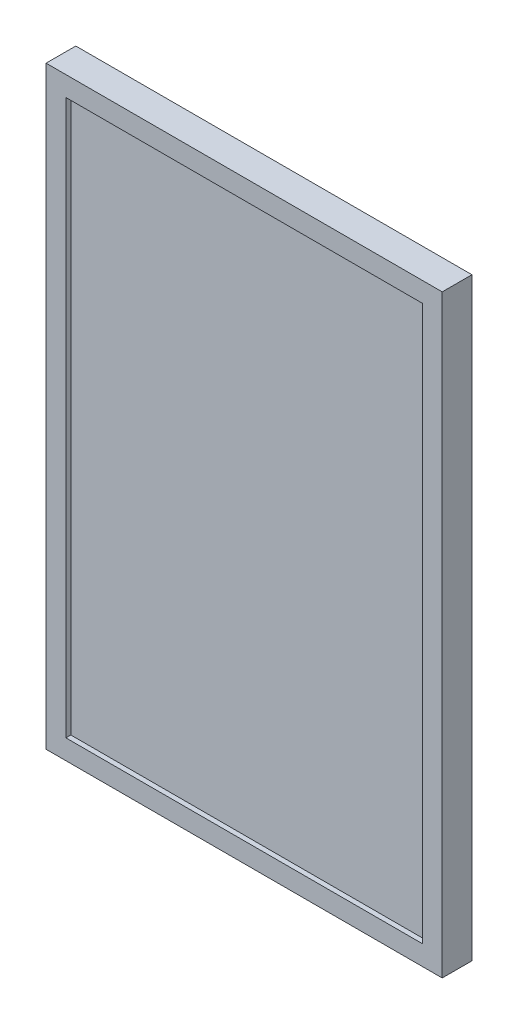
ISO-10303-21;
HEADER;
FILE_DESCRIPTION(('STEP AP214'),'2;1');
FILE_NAME('part.step','',(''),(''),'','','');
FILE_SCHEMA(('AUTOMOTIVE_DESIGN { 1 0 10303 214 1 1 1 1 }'));
ENDSEC;
DATA;
#1=APPLICATION_CONTEXT('core data for automotive mechanical design processes');
#2=APPLICATION_PROTOCOL_DEFINITION('international standard','automotive_design',2000,#1);
#3=PRODUCT_CONTEXT('',#1,'mechanical');
#4=PRODUCT('Part','Part','',(#3));
#5=PRODUCT_RELATED_PRODUCT_CATEGORY('part','',(#4));
#6=PRODUCT_DEFINITION_FORMATION('','',#4);
#7=PRODUCT_DEFINITION_CONTEXT('part definition',#1,'design');
#8=PRODUCT_DEFINITION('design','',#6,#7);
#9=PRODUCT_DEFINITION_SHAPE('','',#8);
#10=(LENGTH_UNIT() NAMED_UNIT(*) SI_UNIT(.MILLI.,.METRE.));
#11=(NAMED_UNIT(*) PLANE_ANGLE_UNIT() SI_UNIT($,.RADIAN.));
#12=(NAMED_UNIT(*) SI_UNIT($,.STERADIAN.) SOLID_ANGLE_UNIT());
#13=UNCERTAINTY_MEASURE_WITH_UNIT(LENGTH_MEASURE(1.E-05),#10,'distance_accuracy_value','');
#14=(GEOMETRIC_REPRESENTATION_CONTEXT(3) GLOBAL_UNCERTAINTY_ASSIGNED_CONTEXT((#13)) GLOBAL_UNIT_ASSIGNED_CONTEXT((#10,
#11,#12)) REPRESENTATION_CONTEXT('',''));
#15=CARTESIAN_POINT('',(0.,0.,0.));
#16=DIRECTION('',(0.,0.,1.));
#17=DIRECTION('',(1.,0.,0.));
#18=AXIS2_PLACEMENT_3D('',#15,#16,#17);
#19=CARTESIAN_POINT('',(-50.2324022346369,57.0435754189944,7.62));
#20=DIRECTION('',(1.,0.,0.));
#21=DIRECTION('',(0.,1.,0.));
#22=AXIS2_PLACEMENT_3D('',#19,#20,#21);
#23=PLANE('',#22);
#24=DIRECTION('',(0.,-1.,0.));
#25=VECTOR('',#24,1.);
#26=CARTESIAN_POINT('',(-50.2324022346369,57.0435754189944,0.));
#27=LINE('',#26,#25);
#28=CARTESIAN_POINT('',(-50.2324022346369,57.0435754189944,0.));
#29=VERTEX_POINT('',#28);
#30=CARTESIAN_POINT('',(-50.2324022346369,-95.3564245810056,0.));
#31=VERTEX_POINT('',#30);
#32=EDGE_CURVE('E144',#29,#31,#27,.T.);
#33=ORIENTED_EDGE('',*,*,#32,.T.);
#34=DIRECTION('',(0.,0.,-1.));
#35=VECTOR('',#34,1.);
#36=CARTESIAN_POINT('',(-50.2324022346369,-95.3564245810056,7.62));
#37=LINE('',#36,#35);
#38=CARTESIAN_POINT('',(-50.2324022346369,-95.3564245810056,7.62));
#39=VERTEX_POINT('',#38);
#40=EDGE_CURVE('E11',#39,#31,#37,.T.);
#41=ORIENTED_EDGE('',*,*,#40,.F.);
#42=DIRECTION('',(0.,-1.,0.));
#43=VECTOR('',#42,1.);
#44=CARTESIAN_POINT('',(-50.2324022346369,57.0435754189944,7.62));
#45=LINE('',#44,#43);
#46=CARTESIAN_POINT('',(-50.2324022346369,57.0435754189944,7.62));
#47=VERTEX_POINT('',#46);
#48=EDGE_CURVE('E148',#47,#39,#45,.T.);
#49=ORIENTED_EDGE('',*,*,#48,.F.);
#50=DIRECTION('',(0.,0.,-1.));
#51=VECTOR('',#50,1.);
#52=CARTESIAN_POINT('',(-50.2324022346369,57.0435754189944,7.62));
#53=LINE('',#52,#51);
#54=EDGE_CURVE('E154',#47,#29,#53,.T.);
#55=ORIENTED_EDGE('',*,*,#54,.T.);
#56=EDGE_LOOP('',(#33,#41,#49,#55));
#57=FACE_BOUND('',#56,.T.);
#58=ADVANCED_FACE('F37',(#57),#23,.F.);
#59=CARTESIAN_POINT('',(-50.2324022346369,-95.3564245810056,7.62));
#60=DIRECTION('',(0.,1.,0.));
#61=DIRECTION('',(0.,0.,1.));
#62=AXIS2_PLACEMENT_3D('',#59,#60,#61);
#63=PLANE('',#62);
#64=DIRECTION('',(1.,0.,0.));
#65=VECTOR('',#64,1.);
#66=CARTESIAN_POINT('',(-50.2324022346369,-95.3564245810056,0.));
#67=LINE('',#66,#65);
#68=CARTESIAN_POINT('',(51.3675977653631,-95.3564245810056,0.));
#69=VERTEX_POINT('',#68);
#70=EDGE_CURVE('E157',#31,#69,#67,.T.);
#71=ORIENTED_EDGE('',*,*,#70,.T.);
#72=DIRECTION('',(0.,0.,-1.));
#73=VECTOR('',#72,1.);
#74=CARTESIAN_POINT('',(51.3675977653631,-95.3564245810056,7.62));
#75=LINE('',#74,#73);
#76=CARTESIAN_POINT('',(51.3675977653631,-95.3564245810056,7.62));
#77=VERTEX_POINT('',#76);
#78=EDGE_CURVE('E44',#77,#69,#75,.T.);
#79=ORIENTED_EDGE('',*,*,#78,.F.);
#80=DIRECTION('',(1.,0.,0.));
#81=VECTOR('',#80,1.);
#82=CARTESIAN_POINT('',(-50.2324022346369,-95.3564245810056,7.62));
#83=LINE('',#82,#81);
#84=EDGE_CURVE('E88',#39,#77,#83,.T.);
#85=ORIENTED_EDGE('',*,*,#84,.F.);
#86=ORIENTED_EDGE('',*,*,#40,.T.);
#87=EDGE_LOOP('',(#71,#79,#85,#86));
#88=FACE_BOUND('',#87,.T.);
#89=ADVANCED_FACE('F186',(#88),#63,.F.);
#90=CARTESIAN_POINT('',(51.3675977653631,57.0435754189944,7.62));
#91=DIRECTION('',(-1.,0.,0.));
#92=DIRECTION('',(0.,-1.,0.));
#93=AXIS2_PLACEMENT_3D('',#90,#91,#92);
#94=PLANE('',#93);
#95=DIRECTION('',(0.,1.,0.));
#96=VECTOR('',#95,1.);
#97=CARTESIAN_POINT('',(51.3675977653631,57.0435754189944,0.));
#98=LINE('',#97,#96);
#99=CARTESIAN_POINT('',(51.3675977653631,57.0435754189944,0.));
#100=VERTEX_POINT('',#99);
#101=EDGE_CURVE('E159',#69,#100,#98,.T.);
#102=ORIENTED_EDGE('',*,*,#101,.T.);
#103=DIRECTION('',(0.,0.,-1.));
#104=VECTOR('',#103,1.);
#105=CARTESIAN_POINT('',(51.3675977653631,57.0435754189944,7.62));
#106=LINE('',#105,#104);
#107=CARTESIAN_POINT('',(51.3675977653631,57.0435754189944,7.62));
#108=VERTEX_POINT('',#107);
#109=EDGE_CURVE('E163',#108,#100,#106,.T.);
#110=ORIENTED_EDGE('',*,*,#109,.F.);
#111=DIRECTION('',(0.,1.,0.));
#112=VECTOR('',#111,1.);
#113=CARTESIAN_POINT('',(51.3675977653631,57.0435754189944,7.62));
#114=LINE('',#113,#112);
#115=EDGE_CURVE('E151',#77,#108,#114,.T.);
#116=ORIENTED_EDGE('',*,*,#115,.F.);
#117=ORIENTED_EDGE('',*,*,#78,.T.);
#118=EDGE_LOOP('',(#102,#110,#116,#117));
#119=FACE_BOUND('',#118,.T.);
#120=ADVANCED_FACE('F168',(#119),#94,.F.);
#121=CARTESIAN_POINT('',(-50.2324022346369,57.0435754189944,7.62));
#122=DIRECTION('',(0.,-1.,0.));
#123=DIRECTION('',(0.,0.,-1.));
#124=AXIS2_PLACEMENT_3D('',#121,#122,#123);
#125=PLANE('',#124);
#126=DIRECTION('',(-1.,0.,0.));
#127=VECTOR('',#126,1.);
#128=CARTESIAN_POINT('',(-50.2324022346369,57.0435754189944,0.));
#129=LINE('',#128,#127);
#130=EDGE_CURVE('E81',#100,#29,#129,.T.);
#131=ORIENTED_EDGE('',*,*,#130,.T.);
#132=ORIENTED_EDGE('',*,*,#54,.F.);
#133=DIRECTION('',(-1.,0.,0.));
#134=VECTOR('',#133,1.);
#135=CARTESIAN_POINT('',(-50.2324022346369,57.0435754189944,7.62));
#136=LINE('',#135,#134);
#137=EDGE_CURVE('E60',#108,#47,#136,.T.);
#138=ORIENTED_EDGE('',*,*,#137,.F.);
#139=ORIENTED_EDGE('',*,*,#109,.T.);
#140=EDGE_LOOP('',(#131,#132,#138,#139));
#141=FACE_BOUND('',#140,.T.);
#142=ADVANCED_FACE('F176',(#141),#125,.F.);
#143=CARTESIAN_POINT('',(0.,0.,7.62));
#144=DIRECTION('',(0.,0.,1.));
#145=DIRECTION('',(1.,0.,0.));
#146=AXIS2_PLACEMENT_3D('',#143,#144,#145);
#147=PLANE('',#146);
#148=DIRECTION('',(0.,-1.,0.));
#149=VECTOR('',#148,1.);
#150=CARTESIAN_POINT('',(-45.1524022346369,51.9635754189944,7.62));
#151=LINE('',#150,#149);
#152=CARTESIAN_POINT('',(-45.1524022346369,51.9635754189944,7.62));
#153=VERTEX_POINT('',#152);
#154=CARTESIAN_POINT('',(-45.1524022346369,-90.2764245810056,7.62));
#155=VERTEX_POINT('',#154);
#156=EDGE_CURVE('E51',#153,#155,#151,.T.);
#157=ORIENTED_EDGE('',*,*,#156,.F.);
#158=DIRECTION('',(1.,0.,0.));
#159=VECTOR('',#158,1.);
#160=CARTESIAN_POINT('',(-45.1524022346369,51.9635754189944,7.62));
#161=LINE('',#160,#159);
#162=CARTESIAN_POINT('',(46.2875977653631,51.9635754189944,7.62));
#163=VERTEX_POINT('',#162);
#164=EDGE_CURVE('E129',#153,#163,#161,.T.);
#165=ORIENTED_EDGE('',*,*,#164,.T.);
#166=DIRECTION('',(0.,-1.,0.));
#167=VECTOR('',#166,1.);
#168=CARTESIAN_POINT('',(46.2875977653631,51.9635754189944,7.62));
#169=LINE('',#168,#167);
#170=CARTESIAN_POINT('',(46.2875977653632,-90.2764245810056,7.62));
#171=VERTEX_POINT('',#170);
#172=EDGE_CURVE('E132',#163,#171,#169,.T.);
#173=ORIENTED_EDGE('',*,*,#172,.T.);
#174=DIRECTION('',(1.,0.,0.));
#175=VECTOR('',#174,1.);
#176=CARTESIAN_POINT('',(-45.1524022346369,-90.2764245810056,7.62));
#177=LINE('',#176,#175);
#178=EDGE_CURVE('E138',#155,#171,#177,.T.);
#179=ORIENTED_EDGE('',*,*,#178,.F.);
#180=EDGE_LOOP('',(#157,#165,#173,#179));
#181=FACE_BOUND('',#180,.T.);
#182=ORIENTED_EDGE('',*,*,#48,.T.);
#183=ORIENTED_EDGE('',*,*,#84,.T.);
#184=ORIENTED_EDGE('',*,*,#115,.T.);
#185=ORIENTED_EDGE('',*,*,#137,.T.);
#186=EDGE_LOOP('',(#182,#183,#184,#185));
#187=FACE_BOUND('',#186,.T.);
#188=ADVANCED_FACE('F178',(#181,#187),#147,.T.);
#189=CARTESIAN_POINT('',(0.,0.,0.));
#190=DIRECTION('',(0.,0.,1.));
#191=DIRECTION('',(1.,0.,0.));
#192=AXIS2_PLACEMENT_3D('',#189,#190,#191);
#193=PLANE('',#192);
#194=ORIENTED_EDGE('',*,*,#32,.F.);
#195=ORIENTED_EDGE('',*,*,#130,.F.);
#196=ORIENTED_EDGE('',*,*,#101,.F.);
#197=ORIENTED_EDGE('',*,*,#70,.F.);
#198=EDGE_LOOP('',(#194,#195,#196,#197));
#199=FACE_BOUND('',#198,.T.);
#200=ADVANCED_FACE('F172',(#199),#193,.F.);
#201=CARTESIAN_POINT('',(-45.1524022346369,51.9635754189944,6.35));
#202=DIRECTION('',(-1.,0.,0.));
#203=DIRECTION('',(0.,-1.,0.));
#204=AXIS2_PLACEMENT_3D('',#201,#202,#203);
#205=PLANE('',#204);
#206=ORIENTED_EDGE('',*,*,#156,.T.);
#207=DIRECTION('',(0.,0.,1.));
#208=VECTOR('',#207,1.);
#209=CARTESIAN_POINT('',(-45.1524022346369,-90.2764245810056,6.35));
#210=LINE('',#209,#208);
#211=CARTESIAN_POINT('',(-45.1524022346369,-90.2764245810056,6.35));
#212=VERTEX_POINT('',#211);
#213=EDGE_CURVE('E108',#212,#155,#210,.T.);
#214=ORIENTED_EDGE('',*,*,#213,.F.);
#215=DIRECTION('',(0.,-1.,0.));
#216=VECTOR('',#215,1.);
#217=CARTESIAN_POINT('',(-45.1524022346369,51.9635754189944,6.35));
#218=LINE('',#217,#216);
#219=CARTESIAN_POINT('',(-45.1524022346369,51.9635754189944,6.35));
#220=VERTEX_POINT('',#219);
#221=EDGE_CURVE('E112',#220,#212,#218,.T.);
#222=ORIENTED_EDGE('',*,*,#221,.F.);
#223=DIRECTION('',(0.,0.,1.));
#224=VECTOR('',#223,1.);
#225=CARTESIAN_POINT('',(-45.1524022346369,51.9635754189944,6.35));
#226=LINE('',#225,#224);
#227=EDGE_CURVE('E142',#220,#153,#226,.T.);
#228=ORIENTED_EDGE('',*,*,#227,.T.);
#229=EDGE_LOOP('',(#206,#214,#222,#228));
#230=FACE_BOUND('',#229,.T.);
#231=ADVANCED_FACE('F110',(#230),#205,.F.);
#232=CARTESIAN_POINT('',(-45.1524022346369,51.9635754189944,6.35));
#233=DIRECTION('',(0.,-1.,0.));
#234=DIRECTION('',(0.,0.,-1.));
#235=AXIS2_PLACEMENT_3D('',#232,#233,#234);
#236=PLANE('',#235);
#237=ORIENTED_EDGE('',*,*,#164,.F.);
#238=ORIENTED_EDGE('',*,*,#227,.F.);
#239=DIRECTION('',(1.,0.,0.));
#240=VECTOR('',#239,1.);
#241=CARTESIAN_POINT('',(-45.1524022346369,51.9635754189944,6.35));
#242=LINE('',#241,#240);
#243=CARTESIAN_POINT('',(46.2875977653631,51.9635754189944,6.35));
#244=VERTEX_POINT('',#243);
#245=EDGE_CURVE('E117',#220,#244,#242,.T.);
#246=ORIENTED_EDGE('',*,*,#245,.T.);
#247=DIRECTION('',(0.,0.,1.));
#248=VECTOR('',#247,1.);
#249=CARTESIAN_POINT('',(46.2875977653631,51.9635754189944,6.35));
#250=LINE('',#249,#248);
#251=EDGE_CURVE('E145',#244,#163,#250,.T.);
#252=ORIENTED_EDGE('',*,*,#251,.T.);
#253=EDGE_LOOP('',(#237,#238,#246,#252));
#254=FACE_BOUND('',#253,.T.);
#255=ADVANCED_FACE('F225',(#254),#236,.T.);
#256=CARTESIAN_POINT('',(46.2875977653631,51.9635754189944,6.35));
#257=DIRECTION('',(-1.,0.,0.));
#258=DIRECTION('',(0.,-1.,0.));
#259=AXIS2_PLACEMENT_3D('',#256,#257,#258);
#260=PLANE('',#259);
#261=ORIENTED_EDGE('',*,*,#172,.F.);
#262=ORIENTED_EDGE('',*,*,#251,.F.);
#263=DIRECTION('',(0.,-1.,0.));
#264=VECTOR('',#263,1.);
#265=CARTESIAN_POINT('',(46.2875977653631,51.9635754189944,6.35));
#266=LINE('',#265,#264);
#267=CARTESIAN_POINT('',(46.2875977653632,-90.2764245810056,6.35));
#268=VERTEX_POINT('',#267);
#269=EDGE_CURVE('E125',#244,#268,#266,.T.);
#270=ORIENTED_EDGE('',*,*,#269,.T.);
#271=DIRECTION('',(0.,0.,1.));
#272=VECTOR('',#271,1.);
#273=CARTESIAN_POINT('',(46.2875977653632,-90.2764245810056,6.35));
#274=LINE('',#273,#272);
#275=EDGE_CURVE('E116',#268,#171,#274,.T.);
#276=ORIENTED_EDGE('',*,*,#275,.T.);
#277=EDGE_LOOP('',(#261,#262,#270,#276));
#278=FACE_BOUND('',#277,.T.);
#279=ADVANCED_FACE('F234',(#278),#260,.T.);
#280=CARTESIAN_POINT('',(-45.1524022346369,-90.2764245810056,6.35));
#281=DIRECTION('',(0.,-1.,0.));
#282=DIRECTION('',(0.,0.,-1.));
#283=AXIS2_PLACEMENT_3D('',#280,#281,#282);
#284=PLANE('',#283);
#285=ORIENTED_EDGE('',*,*,#178,.T.);
#286=ORIENTED_EDGE('',*,*,#275,.F.);
#287=DIRECTION('',(1.,0.,0.));
#288=VECTOR('',#287,1.);
#289=CARTESIAN_POINT('',(-45.1524022346369,-90.2764245810056,6.35));
#290=LINE('',#289,#288);
#291=EDGE_CURVE('E121',#212,#268,#290,.T.);
#292=ORIENTED_EDGE('',*,*,#291,.F.);
#293=ORIENTED_EDGE('',*,*,#213,.T.);
#294=EDGE_LOOP('',(#285,#286,#292,#293));
#295=FACE_BOUND('',#294,.T.);
#296=ADVANCED_FACE('F122',(#295),#284,.F.);
#297=CARTESIAN_POINT('',(0.,0.,6.35));
#298=DIRECTION('',(0.,0.,1.));
#299=DIRECTION('',(1.,0.,0.));
#300=AXIS2_PLACEMENT_3D('',#297,#298,#299);
#301=PLANE('',#300);
#302=ORIENTED_EDGE('',*,*,#221,.T.);
#303=ORIENTED_EDGE('',*,*,#291,.T.);
#304=ORIENTED_EDGE('',*,*,#269,.F.);
#305=ORIENTED_EDGE('',*,*,#245,.F.);
#306=EDGE_LOOP('',(#302,#303,#304,#305));
#307=FACE_BOUND('',#306,.T.);
#308=ADVANCED_FACE('F128',(#307),#301,.T.);
#309=CLOSED_SHELL('',(#58,#89,#120,#142,#188,#200,#231,#255,#279,#296,#308));
#310=MANIFOLD_SOLID_BREP('B2',#309);
#311=ADVANCED_BREP_SHAPE_REPRESENTATION('',(#18,#310),#14);
#312=SHAPE_DEFINITION_REPRESENTATION(#9,#311);
ENDSEC;
END-ISO-10303-21;
